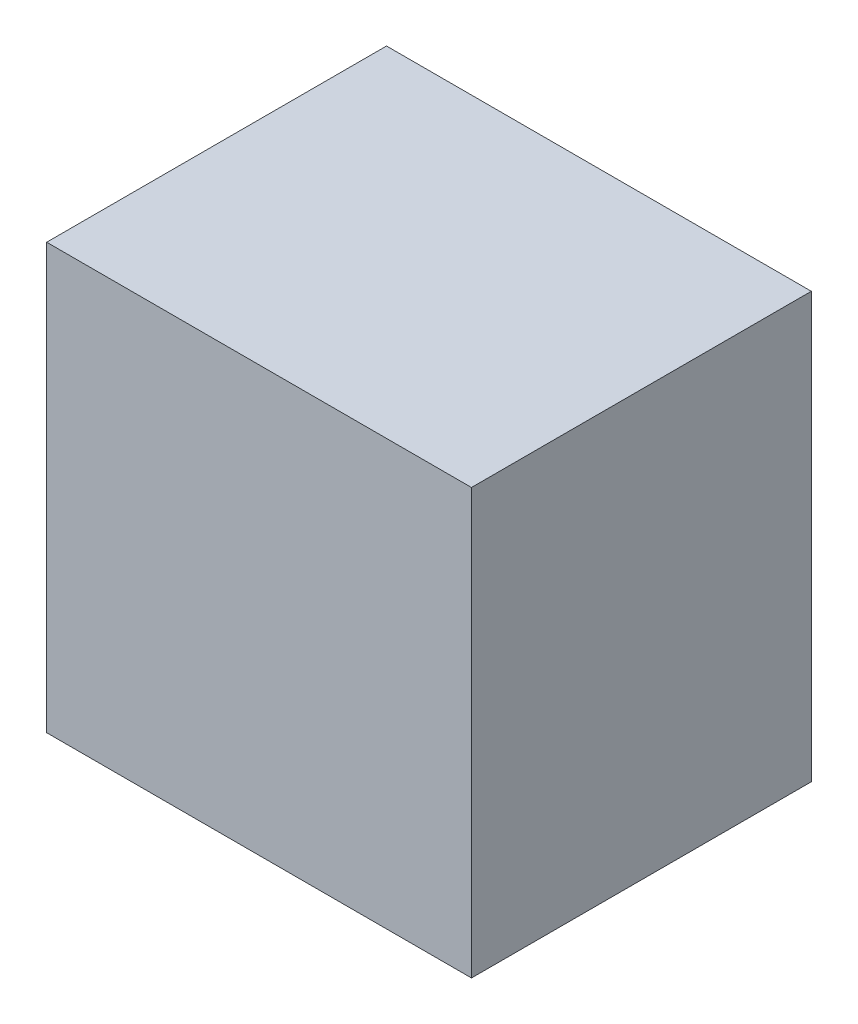
ISO-10303-21;
HEADER;
FILE_DESCRIPTION(('STEP AP214'),'2;1');
FILE_NAME('part.step','',(''),(''),'','','');
FILE_SCHEMA(('AUTOMOTIVE_DESIGN { 1 0 10303 214 1 1 1 1 }'));
ENDSEC;
DATA;
#1=APPLICATION_CONTEXT('core data for automotive mechanical design processes');
#2=APPLICATION_PROTOCOL_DEFINITION('international standard','automotive_design',2000,#1);
#3=PRODUCT_CONTEXT('',#1,'mechanical');
#4=PRODUCT('Part','Part','',(#3));
#5=PRODUCT_RELATED_PRODUCT_CATEGORY('part','',(#4));
#6=PRODUCT_DEFINITION_FORMATION('','',#4);
#7=PRODUCT_DEFINITION_CONTEXT('part definition',#1,'design');
#8=PRODUCT_DEFINITION('design','',#6,#7);
#9=PRODUCT_DEFINITION_SHAPE('','',#8);
#10=(LENGTH_UNIT() NAMED_UNIT(*) SI_UNIT(.MILLI.,.METRE.));
#11=(NAMED_UNIT(*) PLANE_ANGLE_UNIT() SI_UNIT($,.RADIAN.));
#12=(NAMED_UNIT(*) SI_UNIT($,.STERADIAN.) SOLID_ANGLE_UNIT());
#13=UNCERTAINTY_MEASURE_WITH_UNIT(LENGTH_MEASURE(1.E-05),#10,'distance_accuracy_value','');
#14=(GEOMETRIC_REPRESENTATION_CONTEXT(3) GLOBAL_UNCERTAINTY_ASSIGNED_CONTEXT((#13)) GLOBAL_UNIT_ASSIGNED_CONTEXT((#10,
#11,#12)) REPRESENTATION_CONTEXT('',''));
#15=CARTESIAN_POINT('',(0.,0.,0.));
#16=DIRECTION('',(0.,0.,1.));
#17=DIRECTION('',(1.,0.,0.));
#18=AXIS2_PLACEMENT_3D('',#15,#16,#17);
#19=CARTESIAN_POINT('',(0.,0.,20.));
#20=DIRECTION('',(1.,0.,0.));
#21=DIRECTION('',(0.,0.,-1.));
#22=AXIS2_PLACEMENT_3D('',#19,#20,#21);
#23=PLANE('',#22);
#24=DIRECTION('',(0.,-1.,0.));
#25=VECTOR('',#24,1.);
#26=CARTESIAN_POINT('',(0.,0.,0.));
#27=LINE('',#26,#25);
#28=CARTESIAN_POINT('',(0.,25.,0.));
#29=VERTEX_POINT('',#28);
#30=CARTESIAN_POINT('',(0.,0.,0.));
#31=VERTEX_POINT('',#30);
#32=EDGE_CURVE('E96',#29,#31,#27,.T.);
#33=ORIENTED_EDGE('',*,*,#32,.T.);
#34=DIRECTION('',(0.,0.,-1.));
#35=VECTOR('',#34,1.);
#36=CARTESIAN_POINT('',(0.,0.,20.));
#37=LINE('',#36,#35);
#38=CARTESIAN_POINT('',(0.,0.,20.));
#39=VERTEX_POINT('',#38);
#40=EDGE_CURVE('E11',#39,#31,#37,.T.);
#41=ORIENTED_EDGE('',*,*,#40,.F.);
#42=DIRECTION('',(0.,-1.,0.));
#43=VECTOR('',#42,1.);
#44=CARTESIAN_POINT('',(0.,0.,20.));
#45=LINE('',#44,#43);
#46=CARTESIAN_POINT('',(0.,25.,20.));
#47=VERTEX_POINT('',#46);
#48=EDGE_CURVE('E84',#47,#39,#45,.T.);
#49=ORIENTED_EDGE('',*,*,#48,.F.);
#50=DIRECTION('',(0.,0.,-1.));
#51=VECTOR('',#50,1.);
#52=CARTESIAN_POINT('',(0.,25.,20.));
#53=LINE('',#52,#51);
#54=EDGE_CURVE('E92',#47,#29,#53,.T.);
#55=ORIENTED_EDGE('',*,*,#54,.T.);
#56=EDGE_LOOP('',(#33,#41,#49,#55));
#57=FACE_BOUND('',#56,.T.);
#58=ADVANCED_FACE('F33',(#57),#23,.F.);
#59=CARTESIAN_POINT('',(0.,0.,20.));
#60=DIRECTION('',(0.,1.,0.));
#61=DIRECTION('',(0.,0.,1.));
#62=AXIS2_PLACEMENT_3D('',#59,#60,#61);
#63=PLANE('',#62);
#64=DIRECTION('',(1.,0.,0.));
#65=VECTOR('',#64,1.);
#66=CARTESIAN_POINT('',(0.,0.,0.));
#67=LINE('',#66,#65);
#68=CARTESIAN_POINT('',(25.,0.,0.));
#69=VERTEX_POINT('',#68);
#70=EDGE_CURVE('E88',#31,#69,#67,.T.);
#71=ORIENTED_EDGE('',*,*,#70,.T.);
#72=DIRECTION('',(0.,0.,-1.));
#73=VECTOR('',#72,1.);
#74=CARTESIAN_POINT('',(25.,0.,20.));
#75=LINE('',#74,#73);
#76=CARTESIAN_POINT('',(25.,0.,20.));
#77=VERTEX_POINT('',#76);
#78=EDGE_CURVE('E41',#77,#69,#75,.T.);
#79=ORIENTED_EDGE('',*,*,#78,.F.);
#80=DIRECTION('',(1.,0.,0.));
#81=VECTOR('',#80,1.);
#82=CARTESIAN_POINT('',(0.,0.,20.));
#83=LINE('',#82,#81);
#84=EDGE_CURVE('E79',#39,#77,#83,.T.);
#85=ORIENTED_EDGE('',*,*,#84,.F.);
#86=ORIENTED_EDGE('',*,*,#40,.T.);
#87=EDGE_LOOP('',(#71,#79,#85,#86));
#88=FACE_BOUND('',#87,.T.);
#89=ADVANCED_FACE('F87',(#88),#63,.F.);
#90=CARTESIAN_POINT('',(25.,0.,20.));
#91=DIRECTION('',(-1.,0.,0.));
#92=DIRECTION('',(0.,0.,1.));
#93=AXIS2_PLACEMENT_3D('',#90,#91,#92);
#94=PLANE('',#93);
#95=DIRECTION('',(0.,1.,0.));
#96=VECTOR('',#95,1.);
#97=CARTESIAN_POINT('',(25.,0.,0.));
#98=LINE('',#97,#96);
#99=CARTESIAN_POINT('',(25.,25.,0.));
#100=VERTEX_POINT('',#99);
#101=EDGE_CURVE('E66',#69,#100,#98,.T.);
#102=ORIENTED_EDGE('',*,*,#101,.T.);
#103=DIRECTION('',(0.,0.,-1.));
#104=VECTOR('',#103,1.);
#105=CARTESIAN_POINT('',(25.,25.,20.));
#106=LINE('',#105,#104);
#107=CARTESIAN_POINT('',(25.,25.,20.));
#108=VERTEX_POINT('',#107);
#109=EDGE_CURVE('E89',#108,#100,#106,.T.);
#110=ORIENTED_EDGE('',*,*,#109,.F.);
#111=DIRECTION('',(0.,1.,0.));
#112=VECTOR('',#111,1.);
#113=CARTESIAN_POINT('',(25.,0.,20.));
#114=LINE('',#113,#112);
#115=EDGE_CURVE('E82',#77,#108,#114,.T.);
#116=ORIENTED_EDGE('',*,*,#115,.F.);
#117=ORIENTED_EDGE('',*,*,#78,.T.);
#118=EDGE_LOOP('',(#102,#110,#116,#117));
#119=FACE_BOUND('',#118,.T.);
#120=ADVANCED_FACE('F90',(#119),#94,.F.);
#121=CARTESIAN_POINT('',(0.,25.,20.));
#122=DIRECTION('',(0.,-1.,0.));
#123=DIRECTION('',(0.,0.,-1.));
#124=AXIS2_PLACEMENT_3D('',#121,#122,#123);
#125=PLANE('',#124);
#126=DIRECTION('',(-1.,0.,0.));
#127=VECTOR('',#126,1.);
#128=CARTESIAN_POINT('',(0.,25.,0.));
#129=LINE('',#128,#127);
#130=EDGE_CURVE('E72',#100,#29,#129,.T.);
#131=ORIENTED_EDGE('',*,*,#130,.T.);
#132=ORIENTED_EDGE('',*,*,#54,.F.);
#133=DIRECTION('',(-1.,0.,0.));
#134=VECTOR('',#133,1.);
#135=CARTESIAN_POINT('',(0.,25.,20.));
#136=LINE('',#135,#134);
#137=EDGE_CURVE('E49',#108,#47,#136,.T.);
#138=ORIENTED_EDGE('',*,*,#137,.F.);
#139=ORIENTED_EDGE('',*,*,#109,.T.);
#140=EDGE_LOOP('',(#131,#132,#138,#139));
#141=FACE_BOUND('',#140,.T.);
#142=ADVANCED_FACE('F103',(#141),#125,.F.);
#143=CARTESIAN_POINT('',(0.,25.,20.));
#144=DIRECTION('',(0.,0.,-1.));
#145=DIRECTION('',(-1.,0.,0.));
#146=AXIS2_PLACEMENT_3D('',#143,#144,#145);
#147=PLANE('',#146);
#148=ORIENTED_EDGE('',*,*,#48,.T.);
#149=ORIENTED_EDGE('',*,*,#84,.T.);
#150=ORIENTED_EDGE('',*,*,#115,.T.);
#151=ORIENTED_EDGE('',*,*,#137,.T.);
#152=EDGE_LOOP('',(#148,#149,#150,#151));
#153=FACE_BOUND('',#152,.T.);
#154=ADVANCED_FACE('F80',(#153),#147,.F.);
#155=CARTESIAN_POINT('',(0.,25.,0.));
#156=DIRECTION('',(0.,0.,-1.));
#157=DIRECTION('',(-1.,0.,0.));
#158=AXIS2_PLACEMENT_3D('',#155,#156,#157);
#159=PLANE('',#158);
#160=ORIENTED_EDGE('',*,*,#32,.F.);
#161=ORIENTED_EDGE('',*,*,#130,.F.);
#162=ORIENTED_EDGE('',*,*,#101,.F.);
#163=ORIENTED_EDGE('',*,*,#70,.F.);
#164=EDGE_LOOP('',(#160,#161,#162,#163));
#165=FACE_BOUND('',#164,.T.);
#166=ADVANCED_FACE('F106',(#165),#159,.T.);
#167=CLOSED_SHELL('',(#58,#89,#120,#142,#154,#166));
#168=MANIFOLD_SOLID_BREP('B2',#167);
#169=ADVANCED_BREP_SHAPE_REPRESENTATION('',(#18,#168),#14);
#170=SHAPE_DEFINITION_REPRESENTATION(#9,#169);
ENDSEC;
END-ISO-10303-21;
